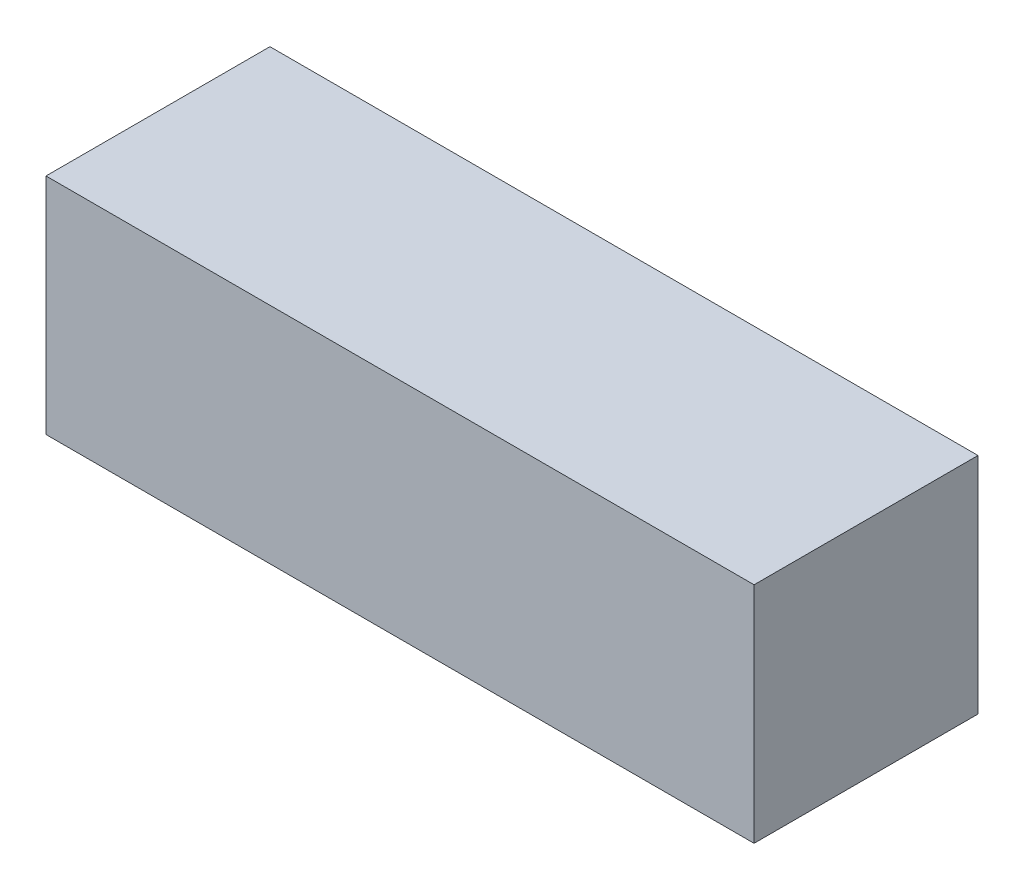
ISO-10303-21;
HEADER;
FILE_DESCRIPTION(('STEP AP214'),'2;1');
FILE_NAME('part.step','',(''),(''),'','','');
FILE_SCHEMA(('AUTOMOTIVE_DESIGN { 1 0 10303 214 1 1 1 1 }'));
ENDSEC;
DATA;
#1=APPLICATION_CONTEXT('core data for automotive mechanical design processes');
#2=APPLICATION_PROTOCOL_DEFINITION('international standard','automotive_design',2000,#1);
#3=PRODUCT_CONTEXT('',#1,'mechanical');
#4=PRODUCT('Part','Part','',(#3));
#5=PRODUCT_RELATED_PRODUCT_CATEGORY('part','',(#4));
#6=PRODUCT_DEFINITION_FORMATION('','',#4);
#7=PRODUCT_DEFINITION_CONTEXT('part definition',#1,'design');
#8=PRODUCT_DEFINITION('design','',#6,#7);
#9=PRODUCT_DEFINITION_SHAPE('','',#8);
#10=(LENGTH_UNIT() NAMED_UNIT(*) SI_UNIT(.MILLI.,.METRE.));
#11=(NAMED_UNIT(*) PLANE_ANGLE_UNIT() SI_UNIT($,.RADIAN.));
#12=(NAMED_UNIT(*) SI_UNIT($,.STERADIAN.) SOLID_ANGLE_UNIT());
#13=UNCERTAINTY_MEASURE_WITH_UNIT(LENGTH_MEASURE(1.E-05),#10,'distance_accuracy_value','');
#14=(GEOMETRIC_REPRESENTATION_CONTEXT(3) GLOBAL_UNCERTAINTY_ASSIGNED_CONTEXT((#13)) GLOBAL_UNIT_ASSIGNED_CONTEXT((#10,
#11,#12)) REPRESENTATION_CONTEXT('',''));
#15=CARTESIAN_POINT('',(0.,0.,0.));
#16=DIRECTION('',(0.,0.,1.));
#17=DIRECTION('',(1.,0.,0.));
#18=AXIS2_PLACEMENT_3D('',#15,#16,#17);
#19=CARTESIAN_POINT('',(80.,50.6,-25.3));
#20=DIRECTION('',(-1.,0.,0.));
#21=DIRECTION('',(0.,0.,1.));
#22=AXIS2_PLACEMENT_3D('',#19,#20,#21);
#23=PLANE('',#22);
#24=DIRECTION('',(0.,0.,-1.));
#25=VECTOR('',#24,1.);
#26=CARTESIAN_POINT('',(80.,0.,-25.3));
#27=LINE('',#26,#25);
#28=CARTESIAN_POINT('',(80.,0.,25.3));
#29=VERTEX_POINT('',#28);
#30=CARTESIAN_POINT('',(80.,0.,-25.3));
#31=VERTEX_POINT('',#30);
#32=EDGE_CURVE('E100',#29,#31,#27,.T.);
#33=ORIENTED_EDGE('',*,*,#32,.T.);
#34=DIRECTION('',(0.,-1.,0.));
#35=VECTOR('',#34,1.);
#36=CARTESIAN_POINT('',(80.,50.6,-25.3));
#37=LINE('',#36,#35);
#38=CARTESIAN_POINT('',(80.,50.6,-25.3));
#39=VERTEX_POINT('',#38);
#40=EDGE_CURVE('E11',#39,#31,#37,.T.);
#41=ORIENTED_EDGE('',*,*,#40,.F.);
#42=DIRECTION('',(0.,0.,-1.));
#43=VECTOR('',#42,1.);
#44=CARTESIAN_POINT('',(80.,50.6,-25.3));
#45=LINE('',#44,#43);
#46=CARTESIAN_POINT('',(80.,50.6,25.3));
#47=VERTEX_POINT('',#46);
#48=EDGE_CURVE('E88',#47,#39,#45,.T.);
#49=ORIENTED_EDGE('',*,*,#48,.F.);
#50=DIRECTION('',(0.,-1.,0.));
#51=VECTOR('',#50,1.);
#52=CARTESIAN_POINT('',(80.,50.6,25.3));
#53=LINE('',#52,#51);
#54=EDGE_CURVE('E96',#47,#29,#53,.T.);
#55=ORIENTED_EDGE('',*,*,#54,.T.);
#56=EDGE_LOOP('',(#33,#41,#49,#55));
#57=FACE_BOUND('',#56,.T.);
#58=ADVANCED_FACE('F37',(#57),#23,.F.);
#59=CARTESIAN_POINT('',(-80.,50.6,-25.3));
#60=DIRECTION('',(0.,0.,1.));
#61=DIRECTION('',(1.,0.,0.));
#62=AXIS2_PLACEMENT_3D('',#59,#60,#61);
#63=PLANE('',#62);
#64=DIRECTION('',(-1.,0.,0.));
#65=VECTOR('',#64,1.);
#66=CARTESIAN_POINT('',(-80.,0.,-25.3));
#67=LINE('',#66,#65);
#68=CARTESIAN_POINT('',(-80.,0.,-25.3));
#69=VERTEX_POINT('',#68);
#70=EDGE_CURVE('E92',#31,#69,#67,.T.);
#71=ORIENTED_EDGE('',*,*,#70,.T.);
#72=DIRECTION('',(0.,-1.,0.));
#73=VECTOR('',#72,1.);
#74=CARTESIAN_POINT('',(-80.,50.6,-25.3));
#75=LINE('',#74,#73);
#76=CARTESIAN_POINT('',(-80.,50.6,-25.3));
#77=VERTEX_POINT('',#76);
#78=EDGE_CURVE('E45',#77,#69,#75,.T.);
#79=ORIENTED_EDGE('',*,*,#78,.F.);
#80=DIRECTION('',(-1.,0.,0.));
#81=VECTOR('',#80,1.);
#82=CARTESIAN_POINT('',(-80.,50.6,-25.3));
#83=LINE('',#82,#81);
#84=EDGE_CURVE('E83',#39,#77,#83,.T.);
#85=ORIENTED_EDGE('',*,*,#84,.F.);
#86=ORIENTED_EDGE('',*,*,#40,.T.);
#87=EDGE_LOOP('',(#71,#79,#85,#86));
#88=FACE_BOUND('',#87,.T.);
#89=ADVANCED_FACE('F91',(#88),#63,.F.);
#90=CARTESIAN_POINT('',(-80.,50.6,-25.3));
#91=DIRECTION('',(1.,0.,0.));
#92=DIRECTION('',(0.,0.,-1.));
#93=AXIS2_PLACEMENT_3D('',#90,#91,#92);
#94=PLANE('',#93);
#95=DIRECTION('',(0.,0.,1.));
#96=VECTOR('',#95,1.);
#97=CARTESIAN_POINT('',(-80.,0.,-25.3));
#98=LINE('',#97,#96);
#99=CARTESIAN_POINT('',(-80.,0.,25.3));
#100=VERTEX_POINT('',#99);
#101=EDGE_CURVE('E70',#69,#100,#98,.T.);
#102=ORIENTED_EDGE('',*,*,#101,.T.);
#103=DIRECTION('',(0.,-1.,0.));
#104=VECTOR('',#103,1.);
#105=CARTESIAN_POINT('',(-80.,50.6,25.3));
#106=LINE('',#105,#104);
#107=CARTESIAN_POINT('',(-80.,50.6,25.3));
#108=VERTEX_POINT('',#107);
#109=EDGE_CURVE('E93',#108,#100,#106,.T.);
#110=ORIENTED_EDGE('',*,*,#109,.F.);
#111=DIRECTION('',(0.,0.,1.));
#112=VECTOR('',#111,1.);
#113=CARTESIAN_POINT('',(-80.,50.6,-25.3));
#114=LINE('',#113,#112);
#115=EDGE_CURVE('E86',#77,#108,#114,.T.);
#116=ORIENTED_EDGE('',*,*,#115,.F.);
#117=ORIENTED_EDGE('',*,*,#78,.T.);
#118=EDGE_LOOP('',(#102,#110,#116,#117));
#119=FACE_BOUND('',#118,.T.);
#120=ADVANCED_FACE('F94',(#119),#94,.F.);
#121=CARTESIAN_POINT('',(-80.,50.6,25.3));
#122=DIRECTION('',(0.,0.,-1.));
#123=DIRECTION('',(-1.,0.,0.));
#124=AXIS2_PLACEMENT_3D('',#121,#122,#123);
#125=PLANE('',#124);
#126=DIRECTION('',(1.,0.,0.));
#127=VECTOR('',#126,1.);
#128=CARTESIAN_POINT('',(-80.,0.,25.3));
#129=LINE('',#128,#127);
#130=EDGE_CURVE('E76',#100,#29,#129,.T.);
#131=ORIENTED_EDGE('',*,*,#130,.T.);
#132=ORIENTED_EDGE('',*,*,#54,.F.);
#133=DIRECTION('',(1.,0.,0.));
#134=VECTOR('',#133,1.);
#135=CARTESIAN_POINT('',(-80.,50.6,25.3));
#136=LINE('',#135,#134);
#137=EDGE_CURVE('E53',#108,#47,#136,.T.);
#138=ORIENTED_EDGE('',*,*,#137,.F.);
#139=ORIENTED_EDGE('',*,*,#109,.T.);
#140=EDGE_LOOP('',(#131,#132,#138,#139));
#141=FACE_BOUND('',#140,.T.);
#142=ADVANCED_FACE('F107',(#141),#125,.F.);
#143=CARTESIAN_POINT('',(0.,50.6,0.));
#144=DIRECTION('',(0.,1.,0.));
#145=DIRECTION('',(0.,0.,1.));
#146=AXIS2_PLACEMENT_3D('',#143,#144,#145);
#147=PLANE('',#146);
#148=ORIENTED_EDGE('',*,*,#48,.T.);
#149=ORIENTED_EDGE('',*,*,#84,.T.);
#150=ORIENTED_EDGE('',*,*,#115,.T.);
#151=ORIENTED_EDGE('',*,*,#137,.T.);
#152=EDGE_LOOP('',(#148,#149,#150,#151));
#153=FACE_BOUND('',#152,.T.);
#154=ADVANCED_FACE('F84',(#153),#147,.T.);
#155=CARTESIAN_POINT('',(0.,0.,0.));
#156=DIRECTION('',(0.,1.,0.));
#157=DIRECTION('',(0.,0.,1.));
#158=AXIS2_PLACEMENT_3D('',#155,#156,#157);
#159=PLANE('',#158);
#160=ORIENTED_EDGE('',*,*,#32,.F.);
#161=ORIENTED_EDGE('',*,*,#130,.F.);
#162=ORIENTED_EDGE('',*,*,#101,.F.);
#163=ORIENTED_EDGE('',*,*,#70,.F.);
#164=EDGE_LOOP('',(#160,#161,#162,#163));
#165=FACE_BOUND('',#164,.T.);
#166=ADVANCED_FACE('F110',(#165),#159,.F.);
#167=CLOSED_SHELL('',(#58,#89,#120,#142,#154,#166));
#168=MANIFOLD_SOLID_BREP('B2',#167);
#169=ADVANCED_BREP_SHAPE_REPRESENTATION('',(#18,#168),#14);
#170=SHAPE_DEFINITION_REPRESENTATION(#9,#169);
ENDSEC;
END-ISO-10303-21;
